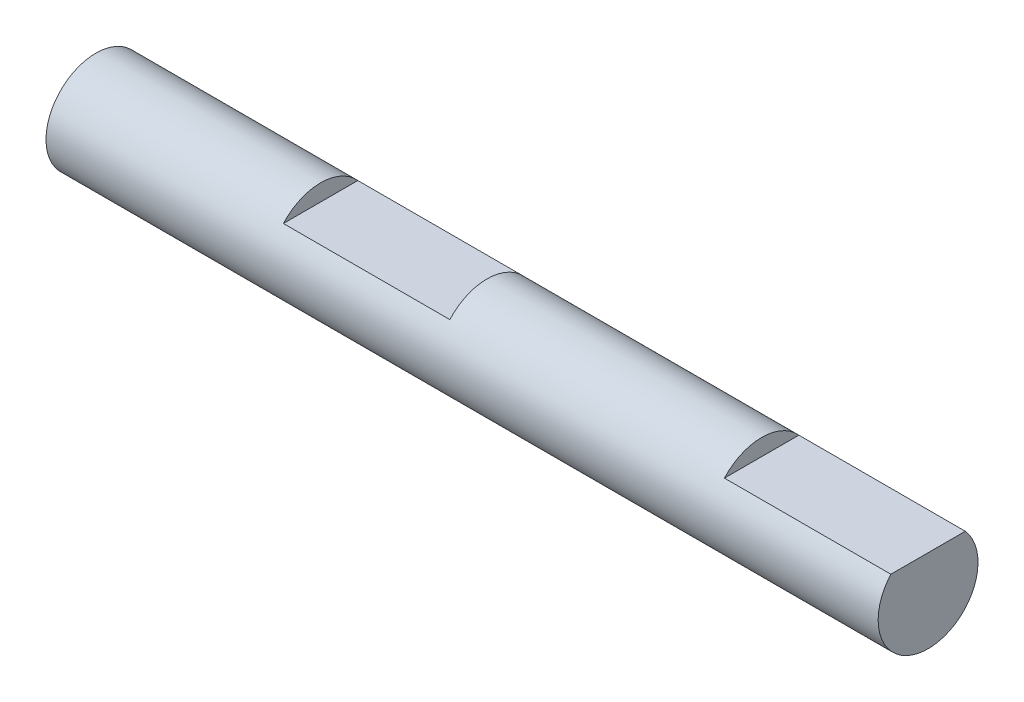
ISO-10303-21;
HEADER;
FILE_DESCRIPTION(('STEP AP214'),'2;1');
FILE_NAME('part.step','',(''),(''),'','','');
FILE_SCHEMA(('AUTOMOTIVE_DESIGN { 1 0 10303 214 1 1 1 1 }'));
ENDSEC;
DATA;
#1=APPLICATION_CONTEXT('core data for automotive mechanical design processes');
#2=APPLICATION_PROTOCOL_DEFINITION('international standard','automotive_design',2000,#1);
#3=PRODUCT_CONTEXT('',#1,'mechanical');
#4=PRODUCT('Part','Part','',(#3));
#5=PRODUCT_RELATED_PRODUCT_CATEGORY('part','',(#4));
#6=PRODUCT_DEFINITION_FORMATION('','',#4);
#7=PRODUCT_DEFINITION_CONTEXT('part definition',#1,'design');
#8=PRODUCT_DEFINITION('design','',#6,#7);
#9=PRODUCT_DEFINITION_SHAPE('','',#8);
#10=(LENGTH_UNIT() NAMED_UNIT(*) SI_UNIT(.MILLI.,.METRE.));
#11=(NAMED_UNIT(*) PLANE_ANGLE_UNIT() SI_UNIT($,.RADIAN.));
#12=(NAMED_UNIT(*) SI_UNIT($,.STERADIAN.) SOLID_ANGLE_UNIT());
#13=UNCERTAINTY_MEASURE_WITH_UNIT(LENGTH_MEASURE(1.E-05),#10,'distance_accuracy_value','');
#14=(GEOMETRIC_REPRESENTATION_CONTEXT(3) GLOBAL_UNCERTAINTY_ASSIGNED_CONTEXT((#13)) GLOBAL_UNIT_ASSIGNED_CONTEXT((#10,
#11,#12)) REPRESENTATION_CONTEXT('',''));
#15=CARTESIAN_POINT('',(0.,0.,0.));
#16=DIRECTION('',(0.,0.,1.));
#17=DIRECTION('',(1.,0.,0.));
#18=AXIS2_PLACEMENT_3D('',#15,#16,#17);
#19=CARTESIAN_POINT('',(0.,0.,0.));
#20=DIRECTION('',(1.,0.,0.));
#21=DIRECTION('',(0.,0.,-1.));
#22=AXIS2_PLACEMENT_3D('',#19,#20,#21);
#23=PLANE('',#22);
#24=CARTESIAN_POINT('',(0.,0.,0.));
#25=DIRECTION('',(-1.,0.,0.));
#26=DIRECTION('',(0.,0.,1.));
#27=AXIS2_PLACEMENT_3D('',#24,#25,#26);
#28=CIRCLE('',#27,3.);
#29=CARTESIAN_POINT('',(0.,0.,3.));
#30=VERTEX_POINT('',#29);
#31=EDGE_CURVE('E86',#30,#30,#28,.T.);
#32=ORIENTED_EDGE('',*,*,#31,.T.);
#33=EDGE_LOOP('',(#32));
#34=FACE_BOUND('',#33,.T.);
#35=ADVANCED_FACE('F34',(#34),#23,.F.);
#36=CARTESIAN_POINT('',(0.,0.,0.));
#37=DIRECTION('',(-1.,0.,0.));
#38=DIRECTION('',(0.,0.,1.));
#39=AXIS2_PLACEMENT_3D('',#36,#37,#38);
#40=CYLINDRICAL_SURFACE('',#39,3.);
#41=CARTESIAN_POINT('',(23.5,0.,0.));
#42=DIRECTION('',(1.,0.,0.));
#43=DIRECTION('',(0.,0.,-1.));
#44=AXIS2_PLACEMENT_3D('',#41,#42,#43);
#45=CIRCLE('',#44,3.);
#46=CARTESIAN_POINT('',(23.5,2.,-2.23606797749979));
#47=VERTEX_POINT('',#46);
#48=CARTESIAN_POINT('',(23.5,2.,2.23606797749979));
#49=VERTEX_POINT('',#48);
#50=EDGE_CURVE('E97',#47,#49,#45,.T.);
#51=ORIENTED_EDGE('',*,*,#50,.T.);
#52=DIRECTION('',(-1.,0.,0.));
#53=VECTOR('',#52,1.);
#54=CARTESIAN_POINT('',(0.,2.,2.23606797749979));
#55=LINE('',#54,#53);
#56=CARTESIAN_POINT('',(13.5,2.,2.23606797749979));
#57=VERTEX_POINT('',#56);
#58=EDGE_CURVE('E79',#49,#57,#55,.T.);
#59=ORIENTED_EDGE('',*,*,#58,.T.);
#60=CARTESIAN_POINT('',(13.5,0.,0.));
#61=DIRECTION('',(-1.,0.,0.));
#62=DIRECTION('',(0.,0.,1.));
#63=AXIS2_PLACEMENT_3D('',#60,#61,#62);
#64=CIRCLE('',#63,3.);
#65=CARTESIAN_POINT('',(13.5,2.,-2.23606797749979));
#66=VERTEX_POINT('',#65);
#67=EDGE_CURVE('E100',#57,#66,#64,.T.);
#68=ORIENTED_EDGE('',*,*,#67,.T.);
#69=DIRECTION('',(-1.,0.,0.));
#70=VECTOR('',#69,1.);
#71=CARTESIAN_POINT('',(0.,2.,-2.23606797749979));
#72=LINE('',#71,#70);
#73=EDGE_CURVE('E89',#66,#47,#72,.F.);
#74=ORIENTED_EDGE('',*,*,#73,.T.);
#75=EDGE_LOOP('',(#51,#59,#68,#74));
#76=FACE_BOUND('',#75,.T.);
#77=ORIENTED_EDGE('',*,*,#31,.F.);
#78=EDGE_LOOP('',(#77));
#79=FACE_BOUND('',#78,.T.);
#80=CARTESIAN_POINT('',(50.,0.,0.));
#81=DIRECTION('',(-1.,0.,0.));
#82=DIRECTION('',(0.,0.,1.));
#83=AXIS2_PLACEMENT_3D('',#80,#81,#82);
#84=CIRCLE('',#83,3.);
#85=CARTESIAN_POINT('',(50.,2.,-2.23606797749979));
#86=VERTEX_POINT('',#85);
#87=CARTESIAN_POINT('',(50.,2.,2.23606797749979));
#88=VERTEX_POINT('',#87);
#89=EDGE_CURVE('E82',#86,#88,#84,.T.);
#90=ORIENTED_EDGE('',*,*,#89,.T.);
#91=DIRECTION('',(-1.,0.,0.));
#92=VECTOR('',#91,1.);
#93=CARTESIAN_POINT('',(0.,2.,2.23606797749979));
#94=LINE('',#93,#92);
#95=CARTESIAN_POINT('',(40.,2.,2.23606797749979));
#96=VERTEX_POINT('',#95);
#97=EDGE_CURVE('E48',#88,#96,#94,.T.);
#98=ORIENTED_EDGE('',*,*,#97,.T.);
#99=CARTESIAN_POINT('',(40.,0.,0.));
#100=DIRECTION('',(-1.,0.,0.));
#101=DIRECTION('',(0.,0.,1.));
#102=AXIS2_PLACEMENT_3D('',#99,#100,#101);
#103=CIRCLE('',#102,3.);
#104=CARTESIAN_POINT('',(40.,2.,-2.23606797749979));
#105=VERTEX_POINT('',#104);
#106=EDGE_CURVE('E11',#96,#105,#103,.T.);
#107=ORIENTED_EDGE('',*,*,#106,.T.);
#108=DIRECTION('',(-1.,0.,0.));
#109=VECTOR('',#108,1.);
#110=CARTESIAN_POINT('',(0.,2.,-2.23606797749979));
#111=LINE('',#110,#109);
#112=EDGE_CURVE('E74',#105,#86,#111,.F.);
#113=ORIENTED_EDGE('',*,*,#112,.T.);
#114=EDGE_LOOP('',(#90,#98,#107,#113));
#115=FACE_BOUND('',#114,.T.);
#116=ADVANCED_FACE('F81',(#76,#79,#115),#40,.T.);
#117=CARTESIAN_POINT('',(50.,0.,0.));
#118=DIRECTION('',(-1.,0.,0.));
#119=DIRECTION('',(0.,0.,1.));
#120=AXIS2_PLACEMENT_3D('',#117,#118,#119);
#121=PLANE('',#120);
#122=ORIENTED_EDGE('',*,*,#89,.F.);
#123=DIRECTION('',(0.,0.,1.));
#124=VECTOR('',#123,1.);
#125=CARTESIAN_POINT('',(50.,2.,0.));
#126=LINE('',#125,#124);
#127=EDGE_CURVE('E41',#86,#88,#126,.T.);
#128=ORIENTED_EDGE('',*,*,#127,.T.);
#129=EDGE_LOOP('',(#122,#128));
#130=FACE_BOUND('',#129,.T.);
#131=ADVANCED_FACE('F85',(#130),#121,.F.);
#132=CARTESIAN_POINT('',(13.5,4.,-3.));
#133=DIRECTION('',(-1.,0.,0.));
#134=DIRECTION('',(0.,0.,1.));
#135=AXIS2_PLACEMENT_3D('',#132,#133,#134);
#136=PLANE('',#135);
#137=DIRECTION('',(0.,0.,1.));
#138=VECTOR('',#137,1.);
#139=CARTESIAN_POINT('',(13.5,2.,-3.));
#140=LINE('',#139,#138);
#141=EDGE_CURVE('E91',#66,#57,#140,.T.);
#142=ORIENTED_EDGE('',*,*,#141,.F.);
#143=ORIENTED_EDGE('',*,*,#67,.F.);
#144=EDGE_LOOP('',(#142,#143));
#145=FACE_BOUND('',#144,.T.);
#146=ADVANCED_FACE('F112',(#145),#136,.F.);
#147=CARTESIAN_POINT('',(23.5,4.,-3.));
#148=DIRECTION('',(1.,0.,0.));
#149=DIRECTION('',(0.,0.,-1.));
#150=AXIS2_PLACEMENT_3D('',#147,#148,#149);
#151=PLANE('',#150);
#152=DIRECTION('',(0.,0.,1.));
#153=VECTOR('',#152,1.);
#154=CARTESIAN_POINT('',(23.5,2.,-3.));
#155=LINE('',#154,#153);
#156=EDGE_CURVE('E56',#47,#49,#155,.T.);
#157=ORIENTED_EDGE('',*,*,#156,.T.);
#158=ORIENTED_EDGE('',*,*,#50,.F.);
#159=EDGE_LOOP('',(#157,#158));
#160=FACE_BOUND('',#159,.T.);
#161=ADVANCED_FACE('F110',(#160),#151,.F.);
#162=CARTESIAN_POINT('',(13.5,2.,-3.));
#163=DIRECTION('',(0.,-1.,0.));
#164=DIRECTION('',(0.,0.,-1.));
#165=AXIS2_PLACEMENT_3D('',#162,#163,#164);
#166=PLANE('',#165);
#167=ORIENTED_EDGE('',*,*,#156,.F.);
#168=ORIENTED_EDGE('',*,*,#73,.F.);
#169=ORIENTED_EDGE('',*,*,#141,.T.);
#170=ORIENTED_EDGE('',*,*,#58,.F.);
#171=EDGE_LOOP('',(#167,#168,#169,#170));
#172=FACE_BOUND('',#171,.T.);
#173=ADVANCED_FACE('F107',(#172),#166,.F.);
#174=CARTESIAN_POINT('',(40.,4.,-3.));
#175=DIRECTION('',(-1.,0.,0.));
#176=DIRECTION('',(0.,0.,1.));
#177=AXIS2_PLACEMENT_3D('',#174,#175,#176);
#178=PLANE('',#177);
#179=DIRECTION('',(0.,0.,1.));
#180=VECTOR('',#179,1.);
#181=CARTESIAN_POINT('',(40.,2.,-3.));
#182=LINE('',#181,#180);
#183=EDGE_CURVE('E83',#105,#96,#182,.T.);
#184=ORIENTED_EDGE('',*,*,#183,.F.);
#185=ORIENTED_EDGE('',*,*,#106,.F.);
#186=EDGE_LOOP('',(#184,#185));
#187=FACE_BOUND('',#186,.T.);
#188=ADVANCED_FACE('F116',(#187),#178,.F.);
#189=CARTESIAN_POINT('',(40.,2.,-3.));
#190=DIRECTION('',(0.,-1.,0.));
#191=DIRECTION('',(0.,0.,-1.));
#192=AXIS2_PLACEMENT_3D('',#189,#190,#191);
#193=PLANE('',#192);
#194=ORIENTED_EDGE('',*,*,#127,.F.);
#195=ORIENTED_EDGE('',*,*,#112,.F.);
#196=ORIENTED_EDGE('',*,*,#183,.T.);
#197=ORIENTED_EDGE('',*,*,#97,.F.);
#198=EDGE_LOOP('',(#194,#195,#196,#197));
#199=FACE_BOUND('',#198,.T.);
#200=ADVANCED_FACE('F73',(#199),#193,.F.);
#201=CLOSED_SHELL('',(#35,#116,#131,#146,#161,#173,#188,#200));
#202=MANIFOLD_SOLID_BREP('B2',#201);
#203=ADVANCED_BREP_SHAPE_REPRESENTATION('',(#18,#202),#14);
#204=SHAPE_DEFINITION_REPRESENTATION(#9,#203);
ENDSEC;
END-ISO-10303-21;
